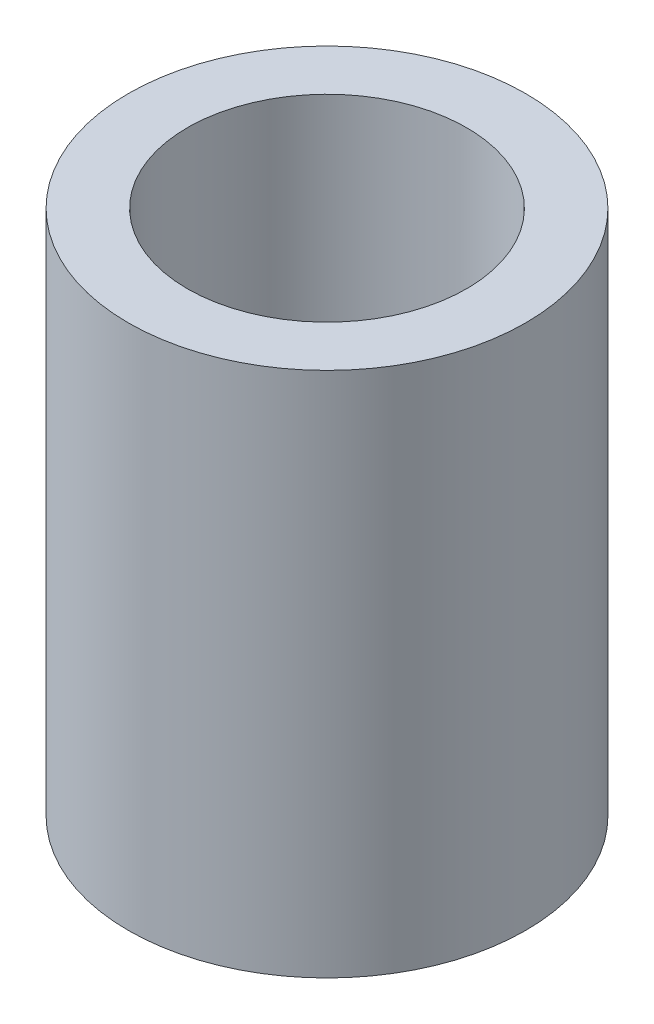
ISO-10303-21;
HEADER;
FILE_DESCRIPTION(('STEP AP214'),'2;1');
FILE_NAME('part.step','',(''),(''),'','','');
FILE_SCHEMA(('AUTOMOTIVE_DESIGN { 1 0 10303 214 1 1 1 1 }'));
ENDSEC;
DATA;
#1=APPLICATION_CONTEXT('core data for automotive mechanical design processes');
#2=APPLICATION_PROTOCOL_DEFINITION('international standard','automotive_design',2000,#1);
#3=PRODUCT_CONTEXT('',#1,'mechanical');
#4=PRODUCT('Part','Part','',(#3));
#5=PRODUCT_RELATED_PRODUCT_CATEGORY('part','',(#4));
#6=PRODUCT_DEFINITION_FORMATION('','',#4);
#7=PRODUCT_DEFINITION_CONTEXT('part definition',#1,'design');
#8=PRODUCT_DEFINITION('design','',#6,#7);
#9=PRODUCT_DEFINITION_SHAPE('','',#8);
#10=(LENGTH_UNIT() NAMED_UNIT(*) SI_UNIT(.MILLI.,.METRE.));
#11=(NAMED_UNIT(*) PLANE_ANGLE_UNIT() SI_UNIT($,.RADIAN.));
#12=(NAMED_UNIT(*) SI_UNIT($,.STERADIAN.) SOLID_ANGLE_UNIT());
#13=UNCERTAINTY_MEASURE_WITH_UNIT(LENGTH_MEASURE(1.E-05),#10,'distance_accuracy_value','');
#14=(GEOMETRIC_REPRESENTATION_CONTEXT(3) GLOBAL_UNCERTAINTY_ASSIGNED_CONTEXT((#13)) GLOBAL_UNIT_ASSIGNED_CONTEXT((#10,
#11,#12)) REPRESENTATION_CONTEXT('',''));
#15=CARTESIAN_POINT('',(0.,0.,0.));
#16=DIRECTION('',(0.,0.,1.));
#17=DIRECTION('',(1.,0.,0.));
#18=AXIS2_PLACEMENT_3D('',#15,#16,#17);
#19=CARTESIAN_POINT('',(0.,12.446,0.));
#20=DIRECTION('',(0.,1.,0.));
#21=DIRECTION('',(0.,0.,1.));
#22=AXIS2_PLACEMENT_3D('',#19,#20,#21);
#23=PLANE('',#22);
#24=CARTESIAN_POINT('',(0.,12.446,0.));
#25=DIRECTION('',(0.,1.,0.));
#26=DIRECTION('',(0.,0.,1.));
#27=AXIS2_PLACEMENT_3D('',#24,#25,#26);
#28=CIRCLE('',#27,4.699);
#29=CARTESIAN_POINT('',(0.,12.446,4.699));
#30=VERTEX_POINT('',#29);
#31=EDGE_CURVE('E10',#30,#30,#28,.T.);
#32=ORIENTED_EDGE('',*,*,#31,.T.);
#33=EDGE_LOOP('',(#32));
#34=FACE_BOUND('',#33,.T.);
#35=CARTESIAN_POINT('',(0.,12.446,0.));
#36=DIRECTION('',(0.,1.,0.));
#37=DIRECTION('',(0.,0.,1.));
#38=AXIS2_PLACEMENT_3D('',#35,#36,#37);
#39=CIRCLE('',#38,3.302);
#40=CARTESIAN_POINT('',(0.,12.446,3.302));
#41=VERTEX_POINT('',#40);
#42=EDGE_CURVE('E43',#41,#41,#39,.T.);
#43=ORIENTED_EDGE('',*,*,#42,.F.);
#44=EDGE_LOOP('',(#43));
#45=FACE_BOUND('',#44,.T.);
#46=ADVANCED_FACE('F32',(#34,#45),#23,.T.);
#47=CARTESIAN_POINT('',(0.,0.,0.));
#48=DIRECTION('',(0.,1.,0.));
#49=DIRECTION('',(0.,0.,1.));
#50=AXIS2_PLACEMENT_3D('',#47,#48,#49);
#51=PLANE('',#50);
#52=CARTESIAN_POINT('',(0.,0.,0.));
#53=DIRECTION('',(0.,1.,0.));
#54=DIRECTION('',(0.,0.,1.));
#55=AXIS2_PLACEMENT_3D('',#52,#53,#54);
#56=CIRCLE('',#55,4.699);
#57=CARTESIAN_POINT('',(0.,0.,4.699));
#58=VERTEX_POINT('',#57);
#59=EDGE_CURVE('E36',#58,#58,#56,.T.);
#60=ORIENTED_EDGE('',*,*,#59,.F.);
#61=EDGE_LOOP('',(#60));
#62=FACE_BOUND('',#61,.T.);
#63=CARTESIAN_POINT('',(0.,0.,0.));
#64=DIRECTION('',(0.,1.,0.));
#65=DIRECTION('',(0.,0.,1.));
#66=AXIS2_PLACEMENT_3D('',#63,#64,#65);
#67=CIRCLE('',#66,3.302);
#68=CARTESIAN_POINT('',(0.,0.,3.302));
#69=VERTEX_POINT('',#68);
#70=EDGE_CURVE('E45',#69,#69,#67,.T.);
#71=ORIENTED_EDGE('',*,*,#70,.T.);
#72=EDGE_LOOP('',(#71));
#73=FACE_BOUND('',#72,.T.);
#74=ADVANCED_FACE('F55',(#62,#73),#51,.F.);
#75=CARTESIAN_POINT('',(0.,12.446,0.));
#76=DIRECTION('',(0.,-1.,0.));
#77=DIRECTION('',(0.,0.,-1.));
#78=AXIS2_PLACEMENT_3D('',#75,#76,#77);
#79=CYLINDRICAL_SURFACE('',#78,4.699);
#80=ORIENTED_EDGE('',*,*,#31,.F.);
#81=EDGE_LOOP('',(#80));
#82=FACE_BOUND('',#81,.T.);
#83=ORIENTED_EDGE('',*,*,#59,.T.);
#84=EDGE_LOOP('',(#83));
#85=FACE_BOUND('',#84,.T.);
#86=ADVANCED_FACE('F34',(#82,#85),#79,.T.);
#87=CARTESIAN_POINT('',(0.,12.446,0.));
#88=DIRECTION('',(0.,-1.,0.));
#89=DIRECTION('',(0.,0.,-1.));
#90=AXIS2_PLACEMENT_3D('',#87,#88,#89);
#91=CYLINDRICAL_SURFACE('',#90,3.302);
#92=ORIENTED_EDGE('',*,*,#42,.T.);
#93=EDGE_LOOP('',(#92));
#94=FACE_BOUND('',#93,.T.);
#95=ORIENTED_EDGE('',*,*,#70,.F.);
#96=EDGE_LOOP('',(#95));
#97=FACE_BOUND('',#96,.T.);
#98=ADVANCED_FACE('F51',(#94,#97),#91,.F.);
#99=CLOSED_SHELL('',(#46,#74,#86,#98));
#100=MANIFOLD_SOLID_BREP('B2',#99);
#101=ADVANCED_BREP_SHAPE_REPRESENTATION('',(#18,#100),#14);
#102=SHAPE_DEFINITION_REPRESENTATION(#9,#101);
ENDSEC;
END-ISO-10303-21;
